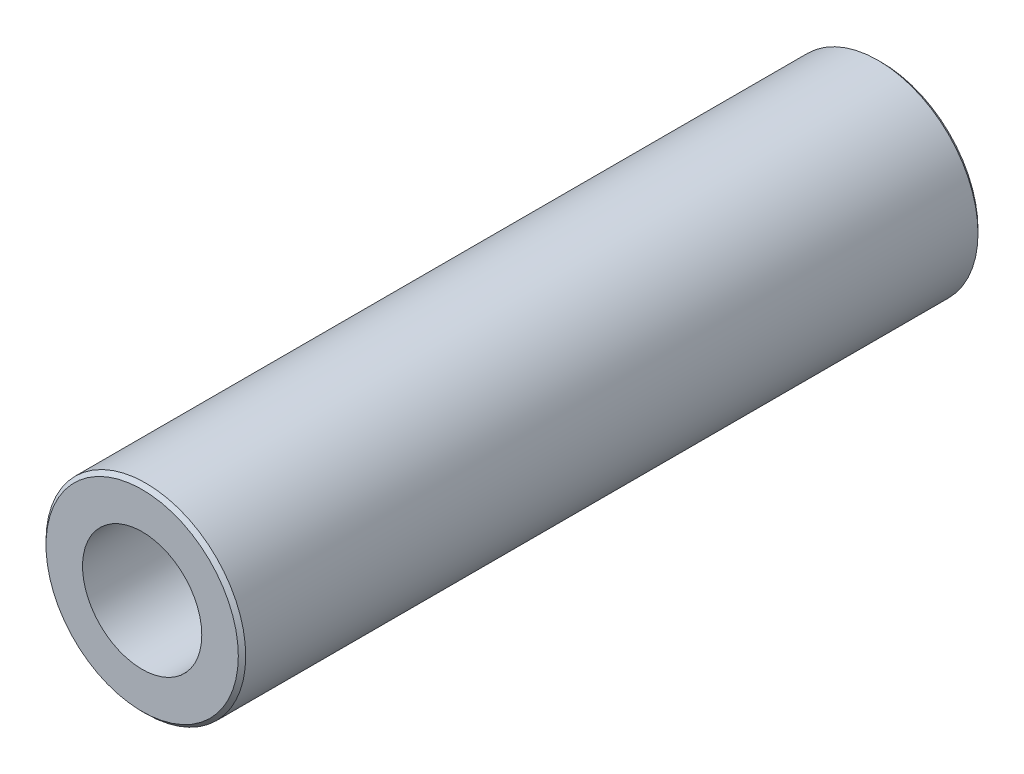
ISO-10303-21;
HEADER;
FILE_DESCRIPTION(('STEP AP214'),'2;1');
FILE_NAME('part.step','',(''),(''),'','','');
FILE_SCHEMA(('AUTOMOTIVE_DESIGN { 1 0 10303 214 1 1 1 1 }'));
ENDSEC;
DATA;
#1=APPLICATION_CONTEXT('core data for automotive mechanical design processes');
#2=APPLICATION_PROTOCOL_DEFINITION('international standard','automotive_design',2000,#1);
#3=PRODUCT_CONTEXT('',#1,'mechanical');
#4=PRODUCT('Part','Part','',(#3));
#5=PRODUCT_RELATED_PRODUCT_CATEGORY('part','',(#4));
#6=PRODUCT_DEFINITION_FORMATION('','',#4);
#7=PRODUCT_DEFINITION_CONTEXT('part definition',#1,'design');
#8=PRODUCT_DEFINITION('design','',#6,#7);
#9=PRODUCT_DEFINITION_SHAPE('','',#8);
#10=(LENGTH_UNIT() NAMED_UNIT(*) SI_UNIT(.MILLI.,.METRE.));
#11=(NAMED_UNIT(*) PLANE_ANGLE_UNIT() SI_UNIT($,.RADIAN.));
#12=(NAMED_UNIT(*) SI_UNIT($,.STERADIAN.) SOLID_ANGLE_UNIT());
#13=UNCERTAINTY_MEASURE_WITH_UNIT(LENGTH_MEASURE(1.E-05),#10,'distance_accuracy_value','');
#14=(GEOMETRIC_REPRESENTATION_CONTEXT(3) GLOBAL_UNCERTAINTY_ASSIGNED_CONTEXT((#13)) GLOBAL_UNIT_ASSIGNED_CONTEXT((#10,
#11,#12)) REPRESENTATION_CONTEXT('',''));
#15=CARTESIAN_POINT('',(0.,0.,0.));
#16=DIRECTION('',(0.,0.,1.));
#17=DIRECTION('',(1.,0.,0.));
#18=AXIS2_PLACEMENT_3D('',#15,#16,#17);
#19=CARTESIAN_POINT('',(0.,0.,0.317499999857531));
#20=DIRECTION('',(0.,0.,1.));
#21=DIRECTION('',(1.,0.,0.));
#22=AXIS2_PLACEMENT_3D('',#19,#20,#21);
#23=CONICAL_SURFACE('',#22,8.57250000014247,0.785398163397448);
#24=CARTESIAN_POINT('',(0.,0.,-1.42471104358499E-10));
#25=DIRECTION('',(0.,0.,1.));
#26=DIRECTION('',(1.,0.,0.));
#27=AXIS2_PLACEMENT_3D('',#24,#25,#26);
#28=CIRCLE('',#27,8.25500000014247);
#29=CARTESIAN_POINT('',(8.25500000014247,0.,-1.42471104358499E-10));
#30=VERTEX_POINT('',#29);
#31=EDGE_CURVE('E51',#30,#30,#28,.T.);
#32=ORIENTED_EDGE('',*,*,#31,.T.);
#33=EDGE_LOOP('',(#32));
#34=FACE_BOUND('',#33,.T.);
#35=CARTESIAN_POINT('',(0.,0.,0.317499999857531));
#36=DIRECTION('',(0.,0.,1.));
#37=DIRECTION('',(1.,0.,0.));
#38=AXIS2_PLACEMENT_3D('',#35,#36,#37);
#39=CIRCLE('',#38,8.57250000014247);
#40=CARTESIAN_POINT('',(8.57250000014247,0.,0.317499999857531));
#41=VERTEX_POINT('',#40);
#42=EDGE_CURVE('E10',#41,#41,#39,.T.);
#43=ORIENTED_EDGE('',*,*,#42,.F.);
#44=EDGE_LOOP('',(#43));
#45=FACE_BOUND('',#44,.T.);
#46=ADVANCED_FACE('F29',(#34,#45),#23,.T.);
#47=CARTESIAN_POINT('',(0.,0.,-1.42471104358499E-10));
#48=DIRECTION('',(0.,0.,1.));
#49=DIRECTION('',(1.,0.,0.));
#50=AXIS2_PLACEMENT_3D('',#47,#48,#49);
#51=CYLINDRICAL_SURFACE('',#50,8.57250000014247);
#52=ORIENTED_EDGE('',*,*,#42,.T.);
#53=EDGE_LOOP('',(#52));
#54=FACE_BOUND('',#53,.T.);
#55=CARTESIAN_POINT('',(0.,0.,63.1824999998575));
#56=DIRECTION('',(0.,0.,1.));
#57=DIRECTION('',(1.,0.,0.));
#58=AXIS2_PLACEMENT_3D('',#55,#56,#57);
#59=CIRCLE('',#58,8.57250000014247);
#60=CARTESIAN_POINT('',(8.57250000014247,0.,63.1824999998575));
#61=VERTEX_POINT('',#60);
#62=EDGE_CURVE('E35',#61,#61,#59,.T.);
#63=ORIENTED_EDGE('',*,*,#62,.F.);
#64=EDGE_LOOP('',(#63));
#65=FACE_BOUND('',#64,.T.);
#66=ADVANCED_FACE('F69',(#54,#65),#51,.T.);
#67=CARTESIAN_POINT('',(0.,0.,63.4999999998575));
#68=DIRECTION('',(0.,0.,-1.));
#69=DIRECTION('',(-1.,0.,0.));
#70=AXIS2_PLACEMENT_3D('',#67,#68,#69);
#71=CONICAL_SURFACE('',#70,8.25500000014247,0.785398163397451);
#72=ORIENTED_EDGE('',*,*,#62,.T.);
#73=EDGE_LOOP('',(#72));
#74=FACE_BOUND('',#73,.T.);
#75=CARTESIAN_POINT('',(0.,0.,63.4999999998575));
#76=DIRECTION('',(0.,0.,1.));
#77=DIRECTION('',(1.,0.,0.));
#78=AXIS2_PLACEMENT_3D('',#75,#76,#77);
#79=CIRCLE('',#78,8.25500000014247);
#80=CARTESIAN_POINT('',(8.25500000014247,0.,63.4999999998575));
#81=VERTEX_POINT('',#80);
#82=EDGE_CURVE('E39',#81,#81,#79,.T.);
#83=ORIENTED_EDGE('',*,*,#82,.F.);
#84=EDGE_LOOP('',(#83));
#85=FACE_BOUND('',#84,.T.);
#86=ADVANCED_FACE('F73',(#74,#85),#71,.T.);
#87=CARTESIAN_POINT('',(5.1181,0.,63.4999999998575));
#88=DIRECTION('',(0.,0.,1.));
#89=DIRECTION('',(1.,0.,0.));
#90=AXIS2_PLACEMENT_3D('',#87,#88,#89);
#91=PLANE('',#90);
#92=ORIENTED_EDGE('',*,*,#82,.T.);
#93=EDGE_LOOP('',(#92));
#94=FACE_BOUND('',#93,.T.);
#95=CARTESIAN_POINT('',(0.,0.,63.4999999998575));
#96=DIRECTION('',(0.,0.,1.));
#97=DIRECTION('',(1.,0.,0.));
#98=AXIS2_PLACEMENT_3D('',#95,#96,#97);
#99=CIRCLE('',#98,5.1181);
#100=CARTESIAN_POINT('',(5.1181,0.,63.4999999998575));
#101=VERTEX_POINT('',#100);
#102=EDGE_CURVE('E43',#101,#101,#99,.T.);
#103=ORIENTED_EDGE('',*,*,#102,.F.);
#104=EDGE_LOOP('',(#103));
#105=FACE_BOUND('',#104,.T.);
#106=ADVANCED_FACE('F65',(#94,#105),#91,.T.);
#107=CARTESIAN_POINT('',(0.,0.,-1.42471104358499E-10));
#108=DIRECTION('',(0.,0.,1.));
#109=DIRECTION('',(1.,0.,0.));
#110=AXIS2_PLACEMENT_3D('',#107,#108,#109);
#111=CYLINDRICAL_SURFACE('',#110,5.1181);
#112=ORIENTED_EDGE('',*,*,#102,.T.);
#113=EDGE_LOOP('',(#112));
#114=FACE_BOUND('',#113,.T.);
#115=CARTESIAN_POINT('',(0.,0.,-1.42471104358499E-10));
#116=DIRECTION('',(0.,0.,1.));
#117=DIRECTION('',(1.,0.,0.));
#118=AXIS2_PLACEMENT_3D('',#115,#116,#117);
#119=CIRCLE('',#118,5.1181);
#120=CARTESIAN_POINT('',(5.1181,0.,-1.42471104358499E-10));
#121=VERTEX_POINT('',#120);
#122=EDGE_CURVE('E48',#121,#121,#119,.T.);
#123=ORIENTED_EDGE('',*,*,#122,.F.);
#124=EDGE_LOOP('',(#123));
#125=FACE_BOUND('',#124,.T.);
#126=ADVANCED_FACE('F59',(#114,#125),#111,.F.);
#127=CARTESIAN_POINT('',(8.25500000014247,0.,-1.42471104358499E-10));
#128=DIRECTION('',(0.,0.,-1.));
#129=DIRECTION('',(-1.,0.,0.));
#130=AXIS2_PLACEMENT_3D('',#127,#128,#129);
#131=PLANE('',#130);
#132=ORIENTED_EDGE('',*,*,#122,.T.);
#133=EDGE_LOOP('',(#132));
#134=FACE_BOUND('',#133,.T.);
#135=ORIENTED_EDGE('',*,*,#31,.F.);
#136=EDGE_LOOP('',(#135));
#137=FACE_BOUND('',#136,.T.);
#138=ADVANCED_FACE('F57',(#134,#137),#131,.T.);
#139=CLOSED_SHELL('',(#46,#66,#86,#106,#126,#138));
#140=MANIFOLD_SOLID_BREP('B2',#139);
#141=ADVANCED_BREP_SHAPE_REPRESENTATION('',(#18,#140),#14);
#142=SHAPE_DEFINITION_REPRESENTATION(#9,#141);
ENDSEC;
END-ISO-10303-21;
